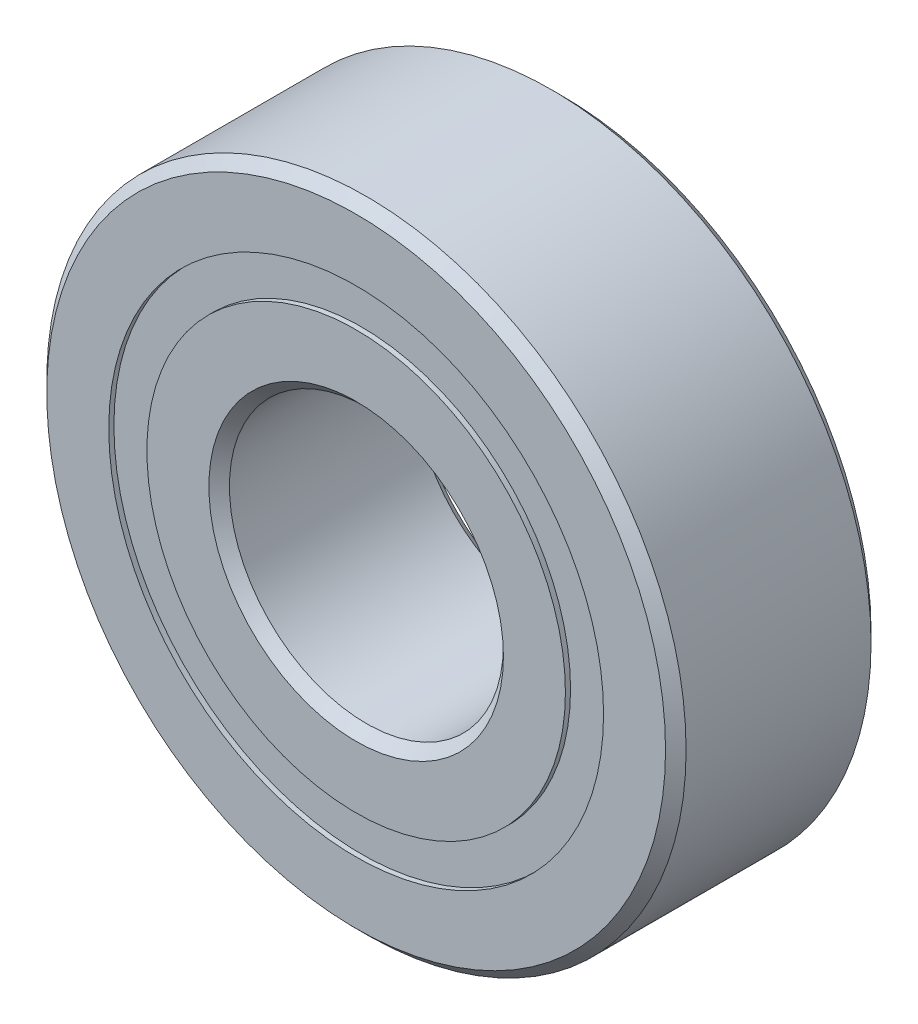
ISO-10303-21;
HEADER;
FILE_DESCRIPTION(('STEP AP214'),'2;1');
FILE_NAME('part.step','',(''),(''),'','','');
FILE_SCHEMA(('AUTOMOTIVE_DESIGN { 1 0 10303 214 1 1 1 1 }'));
ENDSEC;
DATA;
#1=APPLICATION_CONTEXT('core data for automotive mechanical design processes');
#2=APPLICATION_PROTOCOL_DEFINITION('international standard','automotive_design',2000,#1);
#3=PRODUCT_CONTEXT('',#1,'mechanical');
#4=PRODUCT('Part','Part','',(#3));
#5=PRODUCT_RELATED_PRODUCT_CATEGORY('part','',(#4));
#6=PRODUCT_DEFINITION_FORMATION('','',#4);
#7=PRODUCT_DEFINITION_CONTEXT('part definition',#1,'design');
#8=PRODUCT_DEFINITION('design','',#6,#7);
#9=PRODUCT_DEFINITION_SHAPE('','',#8);
#10=(LENGTH_UNIT() NAMED_UNIT(*) SI_UNIT(.MILLI.,.METRE.));
#11=(NAMED_UNIT(*) PLANE_ANGLE_UNIT() SI_UNIT($,.RADIAN.));
#12=(NAMED_UNIT(*) SI_UNIT($,.STERADIAN.) SOLID_ANGLE_UNIT());
#13=UNCERTAINTY_MEASURE_WITH_UNIT(LENGTH_MEASURE(1.E-05),#10,'distance_accuracy_value','');
#14=(GEOMETRIC_REPRESENTATION_CONTEXT(3) GLOBAL_UNCERTAINTY_ASSIGNED_CONTEXT((#13)) GLOBAL_UNIT_ASSIGNED_CONTEXT((#10,
#11,#12)) REPRESENTATION_CONTEXT('',''));
#15=CARTESIAN_POINT('',(0.,0.,0.));
#16=DIRECTION('',(0.,0.,1.));
#17=DIRECTION('',(1.,0.,0.));
#18=AXIS2_PLACEMENT_3D('',#15,#16,#17);
#19=CARTESIAN_POINT('',(0.,8.60041208791209,-3.39328125));
#20=DIRECTION('',(0.,0.,1.));
#21=DIRECTION('',(1.,0.,0.));
#22=AXIS2_PLACEMENT_3D('',#19,#20,#21);
#23=PLANE('',#22);
#24=CARTESIAN_POINT('',(0.,0.,-3.39328125));
#25=DIRECTION('',(0.,0.,1.));
#26=DIRECTION('',(1.,0.,0.));
#27=AXIS2_PLACEMENT_3D('',#24,#25,#26);
#28=CIRCLE('',#27,8.60041208791209);
#29=CARTESIAN_POINT('',(8.60041208791209,0.,-3.39328125));
#30=VERTEX_POINT('',#29);
#31=EDGE_CURVE('E57',#30,#30,#28,.T.);
#32=ORIENTED_EDGE('',*,*,#31,.F.);
#33=EDGE_LOOP('',(#32));
#34=FACE_BOUND('',#33,.T.);
#35=CARTESIAN_POINT('',(0.,0.,-3.39328125));
#36=DIRECTION('',(0.,0.,1.));
#37=DIRECTION('',(1.,0.,0.));
#38=AXIS2_PLACEMENT_3D('',#35,#36,#37);
#39=CIRCLE('',#38,7.27458791208791);
#40=CARTESIAN_POINT('',(7.27458791208791,0.,-3.39328125));
#41=VERTEX_POINT('',#40);
#42=EDGE_CURVE('E11',#41,#41,#39,.T.);
#43=ORIENTED_EDGE('',*,*,#42,.T.);
#44=EDGE_LOOP('',(#43));
#45=FACE_BOUND('',#44,.T.);
#46=ADVANCED_FACE('F43',(#34,#45),#23,.F.);
#47=CARTESIAN_POINT('',(0.,0.,3.571875));
#48=DIRECTION('',(0.,0.,1.));
#49=DIRECTION('',(1.,0.,0.));
#50=AXIS2_PLACEMENT_3D('',#47,#48,#49);
#51=CYLINDRICAL_SURFACE('',#50,7.27458791208791);
#52=ORIENTED_EDGE('',*,*,#42,.F.);
#53=EDGE_LOOP('',(#52));
#54=FACE_BOUND('',#53,.T.);
#55=CARTESIAN_POINT('',(0.,0.,-1.72035132641562));
#56=DIRECTION('',(0.,0.,1.));
#57=DIRECTION('',(1.,0.,0.));
#58=AXIS2_PLACEMENT_3D('',#55,#56,#57);
#59=CIRCLE('',#58,7.27458791208791);
#60=CARTESIAN_POINT('',(7.27458791208791,0.,-1.72035132641562));
#61=VERTEX_POINT('',#60);
#62=EDGE_CURVE('E49',#61,#61,#59,.T.);
#63=ORIENTED_EDGE('',*,*,#62,.T.);
#64=EDGE_LOOP('',(#63));
#65=FACE_BOUND('',#64,.T.);
#66=ADVANCED_FACE('F66',(#54,#65),#51,.F.);
#67=CARTESIAN_POINT('',(0.,8.60041208791209,-1.72035132641562));
#68=DIRECTION('',(0.,0.,-1.));
#69=DIRECTION('',(-1.,0.,0.));
#70=AXIS2_PLACEMENT_3D('',#67,#68,#69);
#71=PLANE('',#70);
#72=ORIENTED_EDGE('',*,*,#62,.F.);
#73=EDGE_LOOP('',(#72));
#74=FACE_BOUND('',#73,.T.);
#75=CARTESIAN_POINT('',(0.,0.,-1.72035132641562));
#76=DIRECTION('',(0.,0.,1.));
#77=DIRECTION('',(1.,0.,0.));
#78=AXIS2_PLACEMENT_3D('',#75,#76,#77);
#79=CIRCLE('',#78,8.60041208791209);
#80=CARTESIAN_POINT('',(8.60041208791209,0.,-1.72035132641562));
#81=VERTEX_POINT('',#80);
#82=EDGE_CURVE('E53',#81,#81,#79,.T.);
#83=ORIENTED_EDGE('',*,*,#82,.T.);
#84=EDGE_LOOP('',(#83));
#85=FACE_BOUND('',#84,.T.);
#86=ADVANCED_FACE('F70',(#74,#85),#71,.F.);
#87=CARTESIAN_POINT('',(0.,0.,3.571875));
#88=DIRECTION('',(0.,0.,1.));
#89=DIRECTION('',(1.,0.,0.));
#90=AXIS2_PLACEMENT_3D('',#87,#88,#89);
#91=CYLINDRICAL_SURFACE('',#90,8.60041208791209);
#92=ORIENTED_EDGE('',*,*,#82,.F.);
#93=EDGE_LOOP('',(#92));
#94=FACE_BOUND('',#93,.T.);
#95=ORIENTED_EDGE('',*,*,#31,.T.);
#96=EDGE_LOOP('',(#95));
#97=FACE_BOUND('',#96,.T.);
#98=ADVANCED_FACE('F63',(#94,#97),#91,.T.);
#99=CLOSED_SHELL('',(#46,#66,#86,#98));
#100=MANIFOLD_SOLID_BREP('B2',#99);
#101=CARTESIAN_POINT('',(0.,8.60041208791209,3.39328125));
#102=DIRECTION('',(0.,0.,-1.));
#103=DIRECTION('',(-1.,0.,0.));
#104=AXIS2_PLACEMENT_3D('',#101,#102,#103);
#105=PLANE('',#104);
#106=CARTESIAN_POINT('',(0.,0.,3.39328125));
#107=DIRECTION('',(0.,0.,1.));
#108=DIRECTION('',(1.,0.,0.));
#109=AXIS2_PLACEMENT_3D('',#106,#107,#108);
#110=CIRCLE('',#109,7.27458791208791);
#111=CARTESIAN_POINT('',(7.27458791208791,0.,3.39328125));
#112=VERTEX_POINT('',#111);
#113=EDGE_CURVE('E42',#112,#112,#110,.T.);
#114=ORIENTED_EDGE('',*,*,#113,.F.);
#115=EDGE_LOOP('',(#114));
#116=FACE_BOUND('',#115,.T.);
#117=CARTESIAN_POINT('',(0.,0.,3.39328125));
#118=DIRECTION('',(0.,0.,1.));
#119=DIRECTION('',(1.,0.,0.));
#120=AXIS2_PLACEMENT_3D('',#117,#118,#119);
#121=CIRCLE('',#120,8.60041208791209);
#122=CARTESIAN_POINT('',(8.60041208791209,0.,3.39328125));
#123=VERTEX_POINT('',#122);
#124=EDGE_CURVE('E124',#123,#123,#121,.T.);
#125=ORIENTED_EDGE('',*,*,#124,.T.);
#126=EDGE_LOOP('',(#125));
#127=FACE_BOUND('',#126,.T.);
#128=ADVANCED_FACE('F110',(#116,#127),#105,.F.);
#129=CARTESIAN_POINT('',(0.,0.,3.571875));
#130=DIRECTION('',(0.,0.,1.));
#131=DIRECTION('',(1.,0.,0.));
#132=AXIS2_PLACEMENT_3D('',#129,#130,#131);
#133=CYLINDRICAL_SURFACE('',#132,7.27458791208791);
#134=CARTESIAN_POINT('',(0.,0.,1.72035132641561));
#135=DIRECTION('',(0.,0.,1.));
#136=DIRECTION('',(1.,0.,0.));
#137=AXIS2_PLACEMENT_3D('',#134,#135,#136);
#138=CIRCLE('',#137,7.27458791208791);
#139=CARTESIAN_POINT('',(7.27458791208791,0.,1.72035132641561));
#140=VERTEX_POINT('',#139);
#141=EDGE_CURVE('E116',#140,#140,#138,.T.);
#142=ORIENTED_EDGE('',*,*,#141,.F.);
#143=EDGE_LOOP('',(#142));
#144=FACE_BOUND('',#143,.T.);
#145=ORIENTED_EDGE('',*,*,#113,.T.);
#146=EDGE_LOOP('',(#145));
#147=FACE_BOUND('',#146,.T.);
#148=ADVANCED_FACE('F139',(#144,#147),#133,.F.);
#149=CARTESIAN_POINT('',(0.,8.60041208791209,1.72035132641561));
#150=DIRECTION('',(0.,0.,1.));
#151=DIRECTION('',(1.,0.,0.));
#152=AXIS2_PLACEMENT_3D('',#149,#150,#151);
#153=PLANE('',#152);
#154=CARTESIAN_POINT('',(0.,0.,1.72035132641561));
#155=DIRECTION('',(0.,0.,1.));
#156=DIRECTION('',(1.,0.,0.));
#157=AXIS2_PLACEMENT_3D('',#154,#155,#156);
#158=CIRCLE('',#157,8.60041208791209);
#159=CARTESIAN_POINT('',(8.60041208791209,0.,1.72035132641561));
#160=VERTEX_POINT('',#159);
#161=EDGE_CURVE('E120',#160,#160,#158,.T.);
#162=ORIENTED_EDGE('',*,*,#161,.F.);
#163=EDGE_LOOP('',(#162));
#164=FACE_BOUND('',#163,.T.);
#165=ORIENTED_EDGE('',*,*,#141,.T.);
#166=EDGE_LOOP('',(#165));
#167=FACE_BOUND('',#166,.T.);
#168=ADVANCED_FACE('F134',(#164,#167),#153,.F.);
#169=CARTESIAN_POINT('',(0.,0.,3.571875));
#170=DIRECTION('',(0.,0.,1.));
#171=DIRECTION('',(1.,0.,0.));
#172=AXIS2_PLACEMENT_3D('',#169,#170,#171);
#173=CYLINDRICAL_SURFACE('',#172,8.60041208791209);
#174=ORIENTED_EDGE('',*,*,#124,.F.);
#175=EDGE_LOOP('',(#174));
#176=FACE_BOUND('',#175,.T.);
#177=ORIENTED_EDGE('',*,*,#161,.T.);
#178=EDGE_LOOP('',(#177));
#179=FACE_BOUND('',#178,.T.);
#180=ADVANCED_FACE('F131',(#176,#179),#173,.T.);
#181=CLOSED_SHELL('',(#128,#148,#168,#180));
#182=MANIFOLD_SOLID_BREP('B6',#181);
#183=CARTESIAN_POINT('',(-3.96874999999991,6.87407664253903,0.));
#184=DIRECTION('',(0.,0.,1.));
#185=DIRECTION('',(-0.499999999999989,0.866025403784445,0.));
#186=AXIS2_PLACEMENT_3D('',#183,#184,#185);
#187=SPHERICAL_SURFACE('',#186,1.72035132641561);
#188=CARTESIAN_POINT('',(-3.96874999999991,6.87407664253903,1.72035132641561));
#189=VERTEX_POINT('',#188);
#190=VERTEX_LOOP('',#189);
#191=FACE_BOUND('',#190,.T.);
#192=ADVANCED_FACE('F177',(#191),#187,.T.);
#193=CLOSED_SHELL('',(#192));
#194=MANIFOLD_SOLID_BREP('B37',#193);
#195=CARTESIAN_POINT('',(-6.87407664253894,3.96875000000008,0.));
#196=DIRECTION('',(0.,0.,1.));
#197=DIRECTION('',(-0.866025403784433,0.50000000000001,0.));
#198=AXIS2_PLACEMENT_3D('',#195,#196,#197);
#199=SPHERICAL_SURFACE('',#198,1.72035132641561);
#200=CARTESIAN_POINT('',(-6.87407664253894,3.96875000000008,1.72035132641561));
#201=VERTEX_POINT('',#200);
#202=VERTEX_LOOP('',#201);
#203=FACE_BOUND('',#202,.T.);
#204=ADVANCED_FACE('F197',(#203),#199,.T.);
#205=CLOSED_SHELL('',(#204));
#206=MANIFOLD_SOLID_BREP('B106',#205);
#207=CARTESIAN_POINT('',(-7.9375,0.,0.));
#208=DIRECTION('',(0.,0.,1.));
#209=DIRECTION('',(-1.,0.,0.));
#210=AXIS2_PLACEMENT_3D('',#207,#208,#209);
#211=SPHERICAL_SURFACE('',#210,1.72035132641561);
#212=CARTESIAN_POINT('',(-7.9375,0.,1.72035132641561));
#213=VERTEX_POINT('',#212);
#214=VERTEX_LOOP('',#213);
#215=FACE_BOUND('',#214,.T.);
#216=ADVANCED_FACE('F217',(#215),#211,.T.);
#217=CLOSED_SHELL('',(#216));
#218=MANIFOLD_SOLID_BREP('B173',#217);
#219=CARTESIAN_POINT('',(-6.87407664253902,-3.96874999999994,0.));
#220=DIRECTION('',(0.,0.,1.));
#221=DIRECTION('',(-0.866025403784443,-0.499999999999992,0.));
#222=AXIS2_PLACEMENT_3D('',#219,#220,#221);
#223=SPHERICAL_SURFACE('',#222,1.72035132641561);
#224=CARTESIAN_POINT('',(-6.87407664253902,-3.96874999999994,1.72035132641561));
#225=VERTEX_POINT('',#224);
#226=VERTEX_LOOP('',#225);
#227=FACE_BOUND('',#226,.T.);
#228=ADVANCED_FACE('F237',(#227),#223,.T.);
#229=CLOSED_SHELL('',(#228));
#230=MANIFOLD_SOLID_BREP('B193',#229);
#231=CARTESIAN_POINT('',(-3.96875000000006,-6.87407664253895,0.));
#232=DIRECTION('',(0.,0.,1.));
#233=DIRECTION('',(-0.500000000000007,-0.866025403784435,0.));
#234=AXIS2_PLACEMENT_3D('',#231,#232,#233);
#235=SPHERICAL_SURFACE('',#234,1.72035132641561);
#236=CARTESIAN_POINT('',(-3.96875000000006,-6.87407664253895,1.72035132641561));
#237=VERTEX_POINT('',#236);
#238=VERTEX_LOOP('',#237);
#239=FACE_BOUND('',#238,.T.);
#240=ADVANCED_FACE('F257',(#239),#235,.T.);
#241=CLOSED_SHELL('',(#240));
#242=MANIFOLD_SOLID_BREP('B213',#241);
#243=CARTESIAN_POINT('',(0.,-7.9375,0.));
#244=DIRECTION('',(0.,0.,1.));
#245=DIRECTION('',(0.,-1.,0.));
#246=AXIS2_PLACEMENT_3D('',#243,#244,#245);
#247=SPHERICAL_SURFACE('',#246,1.72035132641561);
#248=CARTESIAN_POINT('',(0.,-7.9375,1.72035132641561));
#249=VERTEX_POINT('',#248);
#250=VERTEX_LOOP('',#249);
#251=FACE_BOUND('',#250,.T.);
#252=ADVANCED_FACE('F277',(#251),#247,.T.);
#253=CLOSED_SHELL('',(#252));
#254=MANIFOLD_SOLID_BREP('B233',#253);
#255=CARTESIAN_POINT('',(3.96874999999996,-6.87407664253901,0.));
#256=DIRECTION('',(0.,0.,1.));
#257=DIRECTION('',(0.499999999999995,-0.866025403784442,0.));
#258=AXIS2_PLACEMENT_3D('',#255,#256,#257);
#259=SPHERICAL_SURFACE('',#258,1.72035132641561);
#260=CARTESIAN_POINT('',(3.96874999999996,-6.87407664253901,1.72035132641561));
#261=VERTEX_POINT('',#260);
#262=VERTEX_LOOP('',#261);
#263=FACE_BOUND('',#262,.T.);
#264=ADVANCED_FACE('F297',(#263),#259,.T.);
#265=CLOSED_SHELL('',(#264));
#266=MANIFOLD_SOLID_BREP('B253',#265);
#267=CARTESIAN_POINT('',(6.87407664253896,-3.96875000000003,0.));
#268=DIRECTION('',(0.,0.,1.));
#269=DIRECTION('',(0.866025403784436,-0.500000000000004,0.));
#270=AXIS2_PLACEMENT_3D('',#267,#268,#269);
#271=SPHERICAL_SURFACE('',#270,1.72035132641561);
#272=CARTESIAN_POINT('',(6.87407664253896,-3.96875000000003,1.72035132641561));
#273=VERTEX_POINT('',#272);
#274=VERTEX_LOOP('',#273);
#275=FACE_BOUND('',#274,.T.);
#276=ADVANCED_FACE('F317',(#275),#271,.T.);
#277=CLOSED_SHELL('',(#276));
#278=MANIFOLD_SOLID_BREP('B273',#277);
#279=CARTESIAN_POINT('',(7.9375,0.,0.));
#280=DIRECTION('',(0.,0.,1.));
#281=DIRECTION('',(1.,0.,0.));
#282=AXIS2_PLACEMENT_3D('',#279,#280,#281);
#283=SPHERICAL_SURFACE('',#282,1.72035132641561);
#284=CARTESIAN_POINT('',(7.9375,0.,1.72035132641561));
#285=VERTEX_POINT('',#284);
#286=VERTEX_LOOP('',#285);
#287=FACE_BOUND('',#286,.T.);
#288=ADVANCED_FACE('F337',(#287),#283,.T.);
#289=CLOSED_SHELL('',(#288));
#290=MANIFOLD_SOLID_BREP('B293',#289);
#291=CARTESIAN_POINT('',(6.87407664253899,3.96874999999998,0.));
#292=DIRECTION('',(0.,0.,1.));
#293=DIRECTION('',(0.86602540378444,0.499999999999998,0.));
#294=AXIS2_PLACEMENT_3D('',#291,#292,#293);
#295=SPHERICAL_SURFACE('',#294,1.72035132641561);
#296=CARTESIAN_POINT('',(6.87407664253899,3.96874999999998,1.72035132641561));
#297=VERTEX_POINT('',#296);
#298=VERTEX_LOOP('',#297);
#299=FACE_BOUND('',#298,.T.);
#300=ADVANCED_FACE('F357',(#299),#295,.T.);
#301=CLOSED_SHELL('',(#300));
#302=MANIFOLD_SOLID_BREP('B313',#301);
#303=CARTESIAN_POINT('',(3.96875000000001,6.87407664253898,0.));
#304=DIRECTION('',(0.,0.,1.));
#305=DIRECTION('',(0.500000000000001,0.866025403784438,0.));
#306=AXIS2_PLACEMENT_3D('',#303,#304,#305);
#307=SPHERICAL_SURFACE('',#306,1.72035132641561);
#308=CARTESIAN_POINT('',(3.96875000000001,6.87407664253898,1.72035132641561));
#309=VERTEX_POINT('',#308);
#310=VERTEX_LOOP('',#309);
#311=FACE_BOUND('',#310,.T.);
#312=ADVANCED_FACE('F377',(#311),#307,.T.);
#313=CLOSED_SHELL('',(#312));
#314=MANIFOLD_SOLID_BREP('B333',#313);
#315=CARTESIAN_POINT('',(0.,7.9375,0.));
#316=DIRECTION('',(0.,0.,1.));
#317=DIRECTION('',(0.,1.,0.));
#318=AXIS2_PLACEMENT_3D('',#315,#316,#317);
#319=SPHERICAL_SURFACE('',#318,1.72035132641561);
#320=CARTESIAN_POINT('',(0.,7.9375,1.72035132641561));
#321=VERTEX_POINT('',#320);
#322=VERTEX_LOOP('',#321);
#323=FACE_BOUND('',#322,.T.);
#324=ADVANCED_FACE('F399',(#323),#319,.T.);
#325=CLOSED_SHELL('',(#324));
#326=MANIFOLD_SOLID_BREP('B353',#325);
#327=CARTESIAN_POINT('',(0.,7.27458791208791,3.571875));
#328=DIRECTION('',(0.,0.,-1.));
#329=DIRECTION('',(-1.,0.,0.));
#330=AXIS2_PLACEMENT_3D('',#327,#328,#329);
#331=PLANE('',#330);
#332=CARTESIAN_POINT('',(0.,0.,3.571875));
#333=DIRECTION('',(0.,0.,1.));
#334=DIRECTION('',(1.,0.,0.));
#335=AXIS2_PLACEMENT_3D('',#332,#333,#334);
#336=CIRCLE('',#335,5.1196875);
#337=CARTESIAN_POINT('',(5.1196875,0.,3.571875));
#338=VERTEX_POINT('',#337);
#339=EDGE_CURVE('E446',#338,#338,#336,.T.);
#340=ORIENTED_EDGE('',*,*,#339,.F.);
#341=EDGE_LOOP('',(#340));
#342=FACE_BOUND('',#341,.T.);
#343=CARTESIAN_POINT('',(0.,0.,3.571875));
#344=DIRECTION('',(0.,0.,1.));
#345=DIRECTION('',(1.,0.,0.));
#346=AXIS2_PLACEMENT_3D('',#343,#344,#345);
#347=CIRCLE('',#346,7.27458791208791);
#348=CARTESIAN_POINT('',(7.27458791208791,0.,3.571875));
#349=VERTEX_POINT('',#348);
#350=EDGE_CURVE('E398',#349,#349,#347,.T.);
#351=ORIENTED_EDGE('',*,*,#350,.T.);
#352=EDGE_LOOP('',(#351));
#353=FACE_BOUND('',#352,.T.);
#354=ADVANCED_FACE('F418',(#342,#353),#331,.F.);
#355=CARTESIAN_POINT('',(0.,0.,3.571875));
#356=DIRECTION('',(0.,0.,1.));
#357=DIRECTION('',(1.,0.,0.));
#358=AXIS2_PLACEMENT_3D('',#355,#356,#357);
#359=CYLINDRICAL_SURFACE('',#358,7.27458791208791);
#360=ORIENTED_EDGE('',*,*,#350,.F.);
#361=EDGE_LOOP('',(#360));
#362=FACE_BOUND('',#361,.T.);
#363=CARTESIAN_POINT('',(0.,0.,1.5875));
#364=DIRECTION('',(0.,0.,1.));
#365=DIRECTION('',(1.,0.,0.));
#366=AXIS2_PLACEMENT_3D('',#363,#364,#365);
#367=CIRCLE('',#366,7.27458791208791);
#368=CARTESIAN_POINT('',(7.27458791208791,0.,1.5875));
#369=VERTEX_POINT('',#368);
#370=EDGE_CURVE('E424',#369,#369,#367,.T.);
#371=ORIENTED_EDGE('',*,*,#370,.T.);
#372=EDGE_LOOP('',(#371));
#373=FACE_BOUND('',#372,.T.);
#374=ADVANCED_FACE('F453',(#362,#373),#359,.T.);
#375=CARTESIAN_POINT('',(0.,0.,0.));
#376=DIRECTION('',(0.,0.,1.));
#377=DIRECTION('',(1.,0.,0.));
#378=AXIS2_PLACEMENT_3D('',#375,#376,#377);
#379=TOROIDAL_SURFACE('',#378,7.9375,1.72035132641561);
#380=ORIENTED_EDGE('',*,*,#370,.F.);
#381=EDGE_LOOP('',(#380));
#382=FACE_BOUND('',#381,.T.);
#383=CARTESIAN_POINT('',(0.,0.,-1.5875));
#384=DIRECTION('',(0.,0.,1.));
#385=DIRECTION('',(1.,0.,0.));
#386=AXIS2_PLACEMENT_3D('',#383,#384,#385);
#387=CIRCLE('',#386,7.27458791208791);
#388=CARTESIAN_POINT('',(7.27458791208791,0.,-1.5875));
#389=VERTEX_POINT('',#388);
#390=EDGE_CURVE('E428',#389,#389,#387,.T.);
#391=ORIENTED_EDGE('',*,*,#390,.T.);
#392=EDGE_LOOP('',(#391));
#393=FACE_BOUND('',#392,.T.);
#394=ADVANCED_FACE('F457',(#382,#393),#379,.F.);
#395=CARTESIAN_POINT('',(0.,0.,3.571875));
#396=DIRECTION('',(0.,0.,1.));
#397=DIRECTION('',(1.,0.,0.));
#398=AXIS2_PLACEMENT_3D('',#395,#396,#397);
#399=CYLINDRICAL_SURFACE('',#398,7.27458791208791);
#400=ORIENTED_EDGE('',*,*,#390,.F.);
#401=EDGE_LOOP('',(#400));
#402=FACE_BOUND('',#401,.T.);
#403=CARTESIAN_POINT('',(0.,0.,-3.571875));
#404=DIRECTION('',(0.,0.,1.));
#405=DIRECTION('',(1.,0.,0.));
#406=AXIS2_PLACEMENT_3D('',#403,#404,#405);
#407=CIRCLE('',#406,7.27458791208791);
#408=CARTESIAN_POINT('',(7.27458791208791,0.,-3.571875));
#409=VERTEX_POINT('',#408);
#410=EDGE_CURVE('E432',#409,#409,#407,.T.);
#411=ORIENTED_EDGE('',*,*,#410,.T.);
#412=EDGE_LOOP('',(#411));
#413=FACE_BOUND('',#412,.T.);
#414=ADVANCED_FACE('F462',(#402,#413),#399,.T.);
#415=CARTESIAN_POINT('',(0.,5.1196875,-3.571875));
#416=DIRECTION('',(0.,0.,1.));
#417=DIRECTION('',(1.,0.,0.));
#418=AXIS2_PLACEMENT_3D('',#415,#416,#417);
#419=PLANE('',#418);
#420=ORIENTED_EDGE('',*,*,#410,.F.);
#421=EDGE_LOOP('',(#420));
#422=FACE_BOUND('',#421,.T.);
#423=CARTESIAN_POINT('',(0.,0.,-3.571875));
#424=DIRECTION('',(0.,0.,1.));
#425=DIRECTION('',(1.,0.,0.));
#426=AXIS2_PLACEMENT_3D('',#423,#424,#425);
#427=CIRCLE('',#426,5.1196875);
#428=CARTESIAN_POINT('',(5.1196875,0.,-3.571875));
#429=VERTEX_POINT('',#428);
#430=EDGE_CURVE('E437',#429,#429,#427,.T.);
#431=ORIENTED_EDGE('',*,*,#430,.T.);
#432=EDGE_LOOP('',(#431));
#433=FACE_BOUND('',#432,.T.);
#434=ADVANCED_FACE('F468',(#422,#433),#419,.F.);
#435=CARTESIAN_POINT('',(0.,0.,-3.2146875));
#436=DIRECTION('',(0.,0.,-1.));
#437=DIRECTION('',(-1.,0.,0.));
#438=AXIS2_PLACEMENT_3D('',#435,#436,#437);
#439=CONICAL_SURFACE('',#438,4.7625,0.785398163397444);
#440=ORIENTED_EDGE('',*,*,#430,.F.);
#441=EDGE_LOOP('',(#440));
#442=FACE_BOUND('',#441,.T.);
#443=CARTESIAN_POINT('',(0.,0.,-3.2146875));
#444=DIRECTION('',(0.,0.,1.));
#445=DIRECTION('',(1.,0.,0.));
#446=AXIS2_PLACEMENT_3D('',#443,#444,#445);
#447=CIRCLE('',#446,4.7625);
#448=CARTESIAN_POINT('',(4.7625,0.,-3.2146875));
#449=VERTEX_POINT('',#448);
#450=EDGE_CURVE('E440',#449,#449,#447,.T.);
#451=ORIENTED_EDGE('',*,*,#450,.T.);
#452=EDGE_LOOP('',(#451));
#453=FACE_BOUND('',#452,.T.);
#454=ADVANCED_FACE('F472',(#442,#453),#439,.F.);
#455=CARTESIAN_POINT('',(0.,0.,3.571875));
#456=DIRECTION('',(0.,0.,1.));
#457=DIRECTION('',(1.,0.,0.));
#458=AXIS2_PLACEMENT_3D('',#455,#456,#457);
#459=CYLINDRICAL_SURFACE('',#458,4.7625);
#460=ORIENTED_EDGE('',*,*,#450,.F.);
#461=EDGE_LOOP('',(#460));
#462=FACE_BOUND('',#461,.T.);
#463=CARTESIAN_POINT('',(0.,0.,3.21468750000001));
#464=DIRECTION('',(0.,0.,1.));
#465=DIRECTION('',(1.,0.,0.));
#466=AXIS2_PLACEMENT_3D('',#463,#464,#465);
#467=CIRCLE('',#466,4.7625);
#468=CARTESIAN_POINT('',(4.7625,0.,3.21468750000001));
#469=VERTEX_POINT('',#468);
#470=EDGE_CURVE('E443',#469,#469,#467,.T.);
#471=ORIENTED_EDGE('',*,*,#470,.T.);
#472=EDGE_LOOP('',(#471));
#473=FACE_BOUND('',#472,.T.);
#474=ADVANCED_FACE('F476',(#462,#473),#459,.F.);
#475=CARTESIAN_POINT('',(0.,0.,3.571875));
#476=DIRECTION('',(0.,0.,1.));
#477=DIRECTION('',(1.,0.,0.));
#478=AXIS2_PLACEMENT_3D('',#475,#476,#477);
#479=CONICAL_SURFACE('',#478,5.1196875,0.785398163397454);
#480=ORIENTED_EDGE('',*,*,#470,.F.);
#481=EDGE_LOOP('',(#480));
#482=FACE_BOUND('',#481,.T.);
#483=ORIENTED_EDGE('',*,*,#339,.T.);
#484=EDGE_LOOP('',(#483));
#485=FACE_BOUND('',#484,.T.);
#486=ADVANCED_FACE('F450',(#482,#485),#479,.F.);
#487=CLOSED_SHELL('',(#354,#374,#394,#414,#434,#454,#474,#486));
#488=MANIFOLD_SOLID_BREP('B373',#487);
#489=CARTESIAN_POINT('',(0.,0.,3.2146875));
#490=DIRECTION('',(0.,0.,-1.));
#491=DIRECTION('',(-1.,0.,0.));
#492=AXIS2_PLACEMENT_3D('',#489,#490,#491);
#493=CONICAL_SURFACE('',#492,11.1125,0.785398163397446);
#494=CARTESIAN_POINT('',(0.,0.,3.571875));
#495=DIRECTION('',(0.,0.,1.));
#496=DIRECTION('',(1.,0.,0.));
#497=AXIS2_PLACEMENT_3D('',#494,#495,#496);
#498=CIRCLE('',#497,10.7553125);
#499=CARTESIAN_POINT('',(10.7553125,0.,3.571875));
#500=VERTEX_POINT('',#499);
#501=EDGE_CURVE('E567',#500,#500,#498,.T.);
#502=ORIENTED_EDGE('',*,*,#501,.F.);
#503=EDGE_LOOP('',(#502));
#504=FACE_BOUND('',#503,.T.);
#505=CARTESIAN_POINT('',(0.,0.,3.2146875));
#506=DIRECTION('',(0.,0.,1.));
#507=DIRECTION('',(1.,0.,0.));
#508=AXIS2_PLACEMENT_3D('',#505,#506,#507);
#509=CIRCLE('',#508,11.1125);
#510=CARTESIAN_POINT('',(11.1125,0.,3.2146875));
#511=VERTEX_POINT('',#510);
#512=EDGE_CURVE('E417',#511,#511,#509,.T.);
#513=ORIENTED_EDGE('',*,*,#512,.T.);
#514=EDGE_LOOP('',(#513));
#515=FACE_BOUND('',#514,.T.);
#516=ADVANCED_FACE('F539',(#504,#515),#493,.T.);
#517=CARTESIAN_POINT('',(0.,0.,3.571875));
#518=DIRECTION('',(0.,0.,1.));
#519=DIRECTION('',(1.,0.,0.));
#520=AXIS2_PLACEMENT_3D('',#517,#518,#519);
#521=CYLINDRICAL_SURFACE('',#520,11.1125);
#522=ORIENTED_EDGE('',*,*,#512,.F.);
#523=EDGE_LOOP('',(#522));
#524=FACE_BOUND('',#523,.T.);
#525=CARTESIAN_POINT('',(0.,0.,-3.2146875));
#526=DIRECTION('',(0.,0.,1.));
#527=DIRECTION('',(1.,0.,0.));
#528=AXIS2_PLACEMENT_3D('',#525,#526,#527);
#529=CIRCLE('',#528,11.1125);
#530=CARTESIAN_POINT('',(11.1125,0.,-3.2146875));
#531=VERTEX_POINT('',#530);
#532=EDGE_CURVE('E545',#531,#531,#529,.T.);
#533=ORIENTED_EDGE('',*,*,#532,.T.);
#534=EDGE_LOOP('',(#533));
#535=FACE_BOUND('',#534,.T.);
#536=ADVANCED_FACE('F574',(#524,#535),#521,.T.);
#537=CARTESIAN_POINT('',(0.,0.,-3.571875));
#538=DIRECTION('',(0.,0.,1.));
#539=DIRECTION('',(1.,0.,0.));
#540=AXIS2_PLACEMENT_3D('',#537,#538,#539);
#541=CONICAL_SURFACE('',#540,10.7553125,0.785398163397444);
#542=ORIENTED_EDGE('',*,*,#532,.F.);
#543=EDGE_LOOP('',(#542));
#544=FACE_BOUND('',#543,.T.);
#545=CARTESIAN_POINT('',(0.,0.,-3.571875));
#546=DIRECTION('',(0.,0.,1.));
#547=DIRECTION('',(1.,0.,0.));
#548=AXIS2_PLACEMENT_3D('',#545,#546,#547);
#549=CIRCLE('',#548,10.7553125);
#550=CARTESIAN_POINT('',(10.7553125,0.,-3.571875));
#551=VERTEX_POINT('',#550);
#552=EDGE_CURVE('E549',#551,#551,#549,.T.);
#553=ORIENTED_EDGE('',*,*,#552,.T.);
#554=EDGE_LOOP('',(#553));
#555=FACE_BOUND('',#554,.T.);
#556=ADVANCED_FACE('F578',(#544,#555),#541,.T.);
#557=CARTESIAN_POINT('',(0.,10.7553125,-3.571875));
#558=DIRECTION('',(0.,0.,1.));
#559=DIRECTION('',(1.,0.,0.));
#560=AXIS2_PLACEMENT_3D('',#557,#558,#559);
#561=PLANE('',#560);
#562=ORIENTED_EDGE('',*,*,#552,.F.);
#563=EDGE_LOOP('',(#562));
#564=FACE_BOUND('',#563,.T.);
#565=CARTESIAN_POINT('',(0.,0.,-3.571875));
#566=DIRECTION('',(0.,0.,1.));
#567=DIRECTION('',(1.,0.,0.));
#568=AXIS2_PLACEMENT_3D('',#565,#566,#567);
#569=CIRCLE('',#568,8.60041208791209);
#570=CARTESIAN_POINT('',(8.60041208791209,0.,-3.571875));
#571=VERTEX_POINT('',#570);
#572=EDGE_CURVE('E553',#571,#571,#569,.T.);
#573=ORIENTED_EDGE('',*,*,#572,.T.);
#574=EDGE_LOOP('',(#573));
#575=FACE_BOUND('',#574,.T.);
#576=ADVANCED_FACE('F583',(#564,#575),#561,.F.);
#577=CARTESIAN_POINT('',(0.,0.,3.571875));
#578=DIRECTION('',(0.,0.,1.));
#579=DIRECTION('',(1.,0.,0.));
#580=AXIS2_PLACEMENT_3D('',#577,#578,#579);
#581=CYLINDRICAL_SURFACE('',#580,8.60041208791209);
#582=ORIENTED_EDGE('',*,*,#572,.F.);
#583=EDGE_LOOP('',(#582));
#584=FACE_BOUND('',#583,.T.);
#585=CARTESIAN_POINT('',(0.,0.,-1.5875));
#586=DIRECTION('',(0.,0.,1.));
#587=DIRECTION('',(1.,0.,0.));
#588=AXIS2_PLACEMENT_3D('',#585,#586,#587);
#589=CIRCLE('',#588,8.60041208791209);
#590=CARTESIAN_POINT('',(8.60041208791209,0.,-1.5875));
#591=VERTEX_POINT('',#590);
#592=EDGE_CURVE('E558',#591,#591,#589,.T.);
#593=ORIENTED_EDGE('',*,*,#592,.T.);
#594=EDGE_LOOP('',(#593));
#595=FACE_BOUND('',#594,.T.);
#596=ADVANCED_FACE('F589',(#584,#595),#581,.F.);
#597=CARTESIAN_POINT('',(0.,0.,0.));
#598=DIRECTION('',(0.,0.,1.));
#599=DIRECTION('',(1.,0.,0.));
#600=AXIS2_PLACEMENT_3D('',#597,#598,#599);
#601=TOROIDAL_SURFACE('',#600,7.9375,1.72035132641561);
#602=ORIENTED_EDGE('',*,*,#592,.F.);
#603=EDGE_LOOP('',(#602));
#604=FACE_BOUND('',#603,.T.);
#605=CARTESIAN_POINT('',(0.,0.,1.5875));
#606=DIRECTION('',(0.,0.,1.));
#607=DIRECTION('',(1.,0.,0.));
#608=AXIS2_PLACEMENT_3D('',#605,#606,#607);
#609=CIRCLE('',#608,8.60041208791209);
#610=CARTESIAN_POINT('',(8.60041208791209,0.,1.5875));
#611=VERTEX_POINT('',#610);
#612=EDGE_CURVE('E561',#611,#611,#609,.T.);
#613=ORIENTED_EDGE('',*,*,#612,.T.);
#614=EDGE_LOOP('',(#613));
#615=FACE_BOUND('',#614,.T.);
#616=ADVANCED_FACE('F593',(#604,#615),#601,.F.);
#617=CARTESIAN_POINT('',(0.,0.,3.571875));
#618=DIRECTION('',(0.,0.,1.));
#619=DIRECTION('',(1.,0.,0.));
#620=AXIS2_PLACEMENT_3D('',#617,#618,#619);
#621=CYLINDRICAL_SURFACE('',#620,8.60041208791209);
#622=ORIENTED_EDGE('',*,*,#612,.F.);
#623=EDGE_LOOP('',(#622));
#624=FACE_BOUND('',#623,.T.);
#625=CARTESIAN_POINT('',(0.,0.,3.571875));
#626=DIRECTION('',(0.,0.,1.));
#627=DIRECTION('',(1.,0.,0.));
#628=AXIS2_PLACEMENT_3D('',#625,#626,#627);
#629=CIRCLE('',#628,8.60041208791209);
#630=CARTESIAN_POINT('',(8.60041208791209,0.,3.571875));
#631=VERTEX_POINT('',#630);
#632=EDGE_CURVE('E564',#631,#631,#629,.T.);
#633=ORIENTED_EDGE('',*,*,#632,.T.);
#634=EDGE_LOOP('',(#633));
#635=FACE_BOUND('',#634,.T.);
#636=ADVANCED_FACE('F597',(#624,#635),#621,.F.);
#637=CARTESIAN_POINT('',(0.,10.7553125,3.571875));
#638=DIRECTION('',(0.,0.,-1.));
#639=DIRECTION('',(-1.,0.,0.));
#640=AXIS2_PLACEMENT_3D('',#637,#638,#639);
#641=PLANE('',#640);
#642=ORIENTED_EDGE('',*,*,#632,.F.);
#643=EDGE_LOOP('',(#642));
#644=FACE_BOUND('',#643,.T.);
#645=ORIENTED_EDGE('',*,*,#501,.T.);
#646=EDGE_LOOP('',(#645));
#647=FACE_BOUND('',#646,.T.);
#648=ADVANCED_FACE('F571',(#644,#647),#641,.F.);
#649=CLOSED_SHELL('',(#516,#536,#556,#576,#596,#616,#636,#648));
#650=MANIFOLD_SOLID_BREP('B393',#649);
#651=ADVANCED_BREP_SHAPE_REPRESENTATION('',(#18,#100,#182,#194,#206,#218,#230,#242,#254,#266,
#278,#290,#302,#314,#326,#488,#650),#14);
#652=SHAPE_DEFINITION_REPRESENTATION(#9,#651);
ENDSEC;
END-ISO-10303-21;
